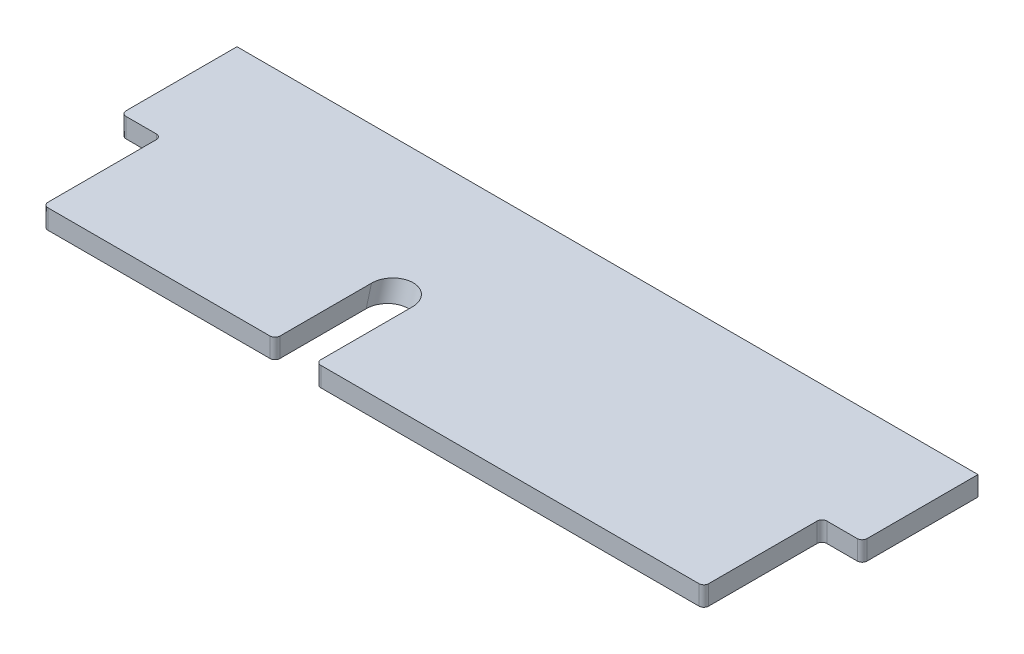
ISO-10303-21;
HEADER;
FILE_DESCRIPTION(('STEP AP214'),'2;1');
FILE_NAME('part.step','',(''),(''),'','','');
FILE_SCHEMA(('AUTOMOTIVE_DESIGN { 1 0 10303 214 1 1 1 1 }'));
ENDSEC;
DATA;
#1=APPLICATION_CONTEXT('core data for automotive mechanical design processes');
#2=APPLICATION_PROTOCOL_DEFINITION('international standard','automotive_design',2000,#1);
#3=PRODUCT_CONTEXT('',#1,'mechanical');
#4=PRODUCT('Part','Part','',(#3));
#5=PRODUCT_RELATED_PRODUCT_CATEGORY('part','',(#4));
#6=PRODUCT_DEFINITION_FORMATION('','',#4);
#7=PRODUCT_DEFINITION_CONTEXT('part definition',#1,'design');
#8=PRODUCT_DEFINITION('design','',#6,#7);
#9=PRODUCT_DEFINITION_SHAPE('','',#8);
#10=(LENGTH_UNIT() NAMED_UNIT(*) SI_UNIT(.MILLI.,.METRE.));
#11=(NAMED_UNIT(*) PLANE_ANGLE_UNIT() SI_UNIT($,.RADIAN.));
#12=(NAMED_UNIT(*) SI_UNIT($,.STERADIAN.) SOLID_ANGLE_UNIT());
#13=UNCERTAINTY_MEASURE_WITH_UNIT(LENGTH_MEASURE(1.E-05),#10,'distance_accuracy_value','');
#14=(GEOMETRIC_REPRESENTATION_CONTEXT(3) GLOBAL_UNCERTAINTY_ASSIGNED_CONTEXT((#13)) GLOBAL_UNIT_ASSIGNED_CONTEXT((#10,
#11,#12)) REPRESENTATION_CONTEXT('',''));
#15=CARTESIAN_POINT('',(0.,0.,0.));
#16=DIRECTION('',(0.,0.,1.));
#17=DIRECTION('',(1.,0.,0.));
#18=AXIS2_PLACEMENT_3D('',#15,#16,#17);
#19=CARTESIAN_POINT('',(-215.9,6.35,76.2));
#20=DIRECTION('',(0.,0.,-1.));
#21=DIRECTION('',(-1.,0.,0.));
#22=AXIS2_PLACEMENT_3D('',#19,#20,#21);
#23=PLANE('',#22);
#24=DIRECTION('',(1.,0.,0.));
#25=VECTOR('',#24,1.);
#26=CARTESIAN_POINT('',(-215.9,-6.35,76.2));
#27=LINE('',#26,#25);
#28=CARTESIAN_POINT('',(-211.963,-6.35,76.2));
#29=VERTEX_POINT('',#28);
#30=CARTESIAN_POINT('',(-67.31,-6.35,76.2));
#31=VERTEX_POINT('',#30);
#32=EDGE_CURVE('E289',#29,#31,#27,.T.);
#33=ORIENTED_EDGE('',*,*,#32,.T.);
#34=DIRECTION('',(0.,-1.,0.));
#35=VECTOR('',#34,1.);
#36=CARTESIAN_POINT('',(-67.31,6.35,76.2));
#37=LINE('',#36,#35);
#38=CARTESIAN_POINT('',(-67.31,6.35,76.2));
#39=VERTEX_POINT('',#38);
#40=EDGE_CURVE('E317',#31,#39,#37,.F.);
#41=ORIENTED_EDGE('',*,*,#40,.T.);
#42=DIRECTION('',(1.,0.,0.));
#43=VECTOR('',#42,1.);
#44=CARTESIAN_POINT('',(-215.9,6.35,76.2));
#45=LINE('',#44,#43);
#46=CARTESIAN_POINT('',(-211.963,6.35,76.2));
#47=VERTEX_POINT('',#46);
#48=EDGE_CURVE('E225',#47,#39,#45,.T.);
#49=ORIENTED_EDGE('',*,*,#48,.F.);
#50=DIRECTION('',(0.,-1.,0.));
#51=VECTOR('',#50,1.);
#52=CARTESIAN_POINT('',(-211.963,6.35,76.2));
#53=LINE('',#52,#51);
#54=EDGE_CURVE('E313',#47,#29,#53,.T.);
#55=ORIENTED_EDGE('',*,*,#54,.T.);
#56=EDGE_LOOP('',(#33,#41,#49,#55));
#57=FACE_BOUND('',#56,.T.);
#58=ADVANCED_FACE('F44',(#57),#23,.F.);
#59=CARTESIAN_POINT('',(215.138,6.35,0.));
#60=DIRECTION('',(-1.,0.,0.));
#61=DIRECTION('',(0.,0.,1.));
#62=AXIS2_PLACEMENT_3D('',#59,#60,#61);
#63=PLANE('',#62);
#64=DIRECTION('',(0.,0.,-1.));
#65=VECTOR('',#64,1.);
#66=CARTESIAN_POINT('',(215.138,-6.35,0.));
#67=LINE('',#66,#65);
#68=CARTESIAN_POINT('',(215.138,-6.35,73.025));
#69=VERTEX_POINT('',#68);
#70=CARTESIAN_POINT('',(215.138,-6.35,2.41300000000001));
#71=VERTEX_POINT('',#70);
#72=EDGE_CURVE('E237',#69,#71,#67,.T.);
#73=ORIENTED_EDGE('',*,*,#72,.T.);
#74=DIRECTION('',(0.,-1.,0.));
#75=VECTOR('',#74,1.);
#76=CARTESIAN_POINT('',(215.138,6.35,2.41300000000001));
#77=LINE('',#76,#75);
#78=CARTESIAN_POINT('',(215.138,6.35,2.41300000000001));
#79=VERTEX_POINT('',#78);
#80=EDGE_CURVE('E369',#71,#79,#77,.F.);
#81=ORIENTED_EDGE('',*,*,#80,.T.);
#82=DIRECTION('',(0.,0.,-1.));
#83=VECTOR('',#82,1.);
#84=CARTESIAN_POINT('',(215.138,6.35,0.));
#85=LINE('',#84,#83);
#86=CARTESIAN_POINT('',(215.138,6.35,73.025));
#87=VERTEX_POINT('',#86);
#88=EDGE_CURVE('E242',#87,#79,#85,.T.);
#89=ORIENTED_EDGE('',*,*,#88,.F.);
#90=DIRECTION('',(0.,-1.,0.));
#91=VECTOR('',#90,1.);
#92=CARTESIAN_POINT('',(215.138,6.35,73.025));
#93=LINE('',#92,#91);
#94=EDGE_CURVE('E365',#87,#69,#93,.T.);
#95=ORIENTED_EDGE('',*,*,#94,.T.);
#96=EDGE_LOOP('',(#73,#81,#89,#95));
#97=FACE_BOUND('',#96,.T.);
#98=ADVANCED_FACE('F425',(#97),#63,.F.);
#99=CARTESIAN_POINT('',(215.9,6.35,-0.761999999999986));
#100=DIRECTION('',(0.,0.,-1.));
#101=DIRECTION('',(-1.,0.,0.));
#102=AXIS2_PLACEMENT_3D('',#99,#100,#101);
#103=PLANE('',#102);
#104=DIRECTION('',(1.,0.,0.));
#105=VECTOR('',#104,1.);
#106=CARTESIAN_POINT('',(215.9,-6.35,-0.761999999999986));
#107=LINE('',#106,#105);
#108=CARTESIAN_POINT('',(218.313,-6.35,-0.761999999999986));
#109=VERTEX_POINT('',#108);
#110=CARTESIAN_POINT('',(238.125,-6.35,-0.761999999999986));
#111=VERTEX_POINT('',#110);
#112=EDGE_CURVE('E220',#109,#111,#107,.T.);
#113=ORIENTED_EDGE('',*,*,#112,.T.);
#114=DIRECTION('',(0.,-1.,0.));
#115=VECTOR('',#114,1.);
#116=CARTESIAN_POINT('',(238.125,6.35,-0.761999999999986));
#117=LINE('',#116,#115);
#118=CARTESIAN_POINT('',(238.125,6.35,-0.761999999999986));
#119=VERTEX_POINT('',#118);
#120=EDGE_CURVE('E362',#111,#119,#117,.F.);
#121=ORIENTED_EDGE('',*,*,#120,.T.);
#122=DIRECTION('',(1.,0.,0.));
#123=VECTOR('',#122,1.);
#124=CARTESIAN_POINT('',(215.9,6.35,-0.761999999999986));
#125=LINE('',#124,#123);
#126=CARTESIAN_POINT('',(218.313,6.35,-0.761999999999986));
#127=VERTEX_POINT('',#126);
#128=EDGE_CURVE('E236',#127,#119,#125,.T.);
#129=ORIENTED_EDGE('',*,*,#128,.F.);
#130=DIRECTION('',(0.,-1.,0.));
#131=VECTOR('',#130,1.);
#132=CARTESIAN_POINT('',(218.313,-6.35,-0.761999999999986));
#133=LINE('',#132,#131);
#134=EDGE_CURVE('E358',#127,#109,#133,.T.);
#135=ORIENTED_EDGE('',*,*,#134,.T.);
#136=EDGE_LOOP('',(#113,#121,#129,#135));
#137=FACE_BOUND('',#136,.T.);
#138=ADVANCED_FACE('F434',(#137),#103,.F.);
#139=CARTESIAN_POINT('',(241.3,6.35,-76.2));
#140=DIRECTION('',(-1.,0.,0.));
#141=DIRECTION('',(0.,0.,1.));
#142=AXIS2_PLACEMENT_3D('',#139,#140,#141);
#143=PLANE('',#142);
#144=DIRECTION('',(0.,0.,-1.));
#145=VECTOR('',#144,1.);
#146=CARTESIAN_POINT('',(241.3,6.35,-76.2));
#147=LINE('',#146,#145);
#148=CARTESIAN_POINT('',(241.3,6.35,-3.93700000000001));
#149=VERTEX_POINT('',#148);
#150=CARTESIAN_POINT('',(241.3,6.35,-76.2));
#151=VERTEX_POINT('',#150);
#152=EDGE_CURVE('E233',#149,#151,#147,.T.);
#153=ORIENTED_EDGE('',*,*,#152,.F.);
#154=DIRECTION('',(0.,-1.,0.));
#155=VECTOR('',#154,1.);
#156=CARTESIAN_POINT('',(241.3,6.35,-3.93699999999998));
#157=LINE('',#156,#155);
#158=CARTESIAN_POINT('',(241.3,-6.35,-3.93700000000001));
#159=VERTEX_POINT('',#158);
#160=EDGE_CURVE('E354',#149,#159,#157,.T.);
#161=ORIENTED_EDGE('',*,*,#160,.T.);
#162=DIRECTION('',(0.,0.,-1.));
#163=VECTOR('',#162,1.);
#164=CARTESIAN_POINT('',(241.3,-6.35,-76.2));
#165=LINE('',#164,#163);
#166=CARTESIAN_POINT('',(241.3,-6.35,-76.2));
#167=VERTEX_POINT('',#166);
#168=EDGE_CURVE('E195',#159,#167,#165,.T.);
#169=ORIENTED_EDGE('',*,*,#168,.T.);
#170=DIRECTION('',(0.,-1.,0.));
#171=VECTOR('',#170,1.);
#172=CARTESIAN_POINT('',(241.3,6.35,-76.2));
#173=LINE('',#172,#171);
#174=EDGE_CURVE('E190',#151,#167,#173,.T.);
#175=ORIENTED_EDGE('',*,*,#174,.F.);
#176=EDGE_LOOP('',(#153,#161,#169,#175));
#177=FACE_BOUND('',#176,.T.);
#178=ADVANCED_FACE('F442',(#177),#143,.F.);
#179=CARTESIAN_POINT('',(-215.9,6.35,-76.2));
#180=DIRECTION('',(0.,0.,1.));
#181=DIRECTION('',(1.,0.,0.));
#182=AXIS2_PLACEMENT_3D('',#179,#180,#181);
#183=PLANE('',#182);
#184=DIRECTION('',(-1.,0.,0.));
#185=VECTOR('',#184,1.);
#186=CARTESIAN_POINT('',(-215.9,-6.35,-76.2));
#187=LINE('',#186,#185);
#188=CARTESIAN_POINT('',(-241.3,-6.35,-76.2));
#189=VERTEX_POINT('',#188);
#190=EDGE_CURVE('E183',#167,#189,#187,.T.);
#191=ORIENTED_EDGE('',*,*,#190,.T.);
#192=DIRECTION('',(0.,-1.,0.));
#193=VECTOR('',#192,1.);
#194=CARTESIAN_POINT('',(-241.3,6.35,-76.2));
#195=LINE('',#194,#193);
#196=CARTESIAN_POINT('',(-241.3,6.35,-76.2));
#197=VERTEX_POINT('',#196);
#198=EDGE_CURVE('E187',#197,#189,#195,.T.);
#199=ORIENTED_EDGE('',*,*,#198,.F.);
#200=DIRECTION('',(-1.,0.,0.));
#201=VECTOR('',#200,1.);
#202=CARTESIAN_POINT('',(215.9,6.35,-76.2));
#203=LINE('',#202,#201);
#204=EDGE_CURVE('E230',#151,#197,#203,.T.);
#205=ORIENTED_EDGE('',*,*,#204,.F.);
#206=ORIENTED_EDGE('',*,*,#174,.T.);
#207=EDGE_LOOP('',(#191,#199,#205,#206));
#208=FACE_BOUND('',#207,.T.);
#209=ADVANCED_FACE('F185',(#208),#183,.F.);
#210=CARTESIAN_POINT('',(-241.3,6.35,-76.2));
#211=DIRECTION('',(1.,0.,0.));
#212=DIRECTION('',(0.,0.,-1.));
#213=AXIS2_PLACEMENT_3D('',#210,#211,#212);
#214=PLANE('',#213);
#215=DIRECTION('',(0.,0.,1.));
#216=VECTOR('',#215,1.);
#217=CARTESIAN_POINT('',(-241.3,-6.35,-76.2));
#218=LINE('',#217,#216);
#219=CARTESIAN_POINT('',(-241.3,-6.35,-3.93700000000001));
#220=VERTEX_POINT('',#219);
#221=EDGE_CURVE('E200',#189,#220,#218,.T.);
#222=ORIENTED_EDGE('',*,*,#221,.T.);
#223=DIRECTION('',(0.,-1.,0.));
#224=VECTOR('',#223,1.);
#225=CARTESIAN_POINT('',(-241.3,6.35,-3.93699999999998));
#226=LINE('',#225,#224);
#227=CARTESIAN_POINT('',(-241.3,6.35,-3.93700000000001));
#228=VERTEX_POINT('',#227);
#229=EDGE_CURVE('E351',#220,#228,#226,.F.);
#230=ORIENTED_EDGE('',*,*,#229,.T.);
#231=DIRECTION('',(0.,0.,1.));
#232=VECTOR('',#231,1.);
#233=CARTESIAN_POINT('',(-241.3,6.35,-76.2));
#234=LINE('',#233,#232);
#235=EDGE_CURVE('E203',#197,#228,#234,.T.);
#236=ORIENTED_EDGE('',*,*,#235,.F.);
#237=ORIENTED_EDGE('',*,*,#198,.T.);
#238=EDGE_LOOP('',(#222,#230,#236,#237));
#239=FACE_BOUND('',#238,.T.);
#240=ADVANCED_FACE('F199',(#239),#214,.F.);
#241=CARTESIAN_POINT('',(-215.9,6.35,-0.76199999999999));
#242=DIRECTION('',(0.,0.,-1.));
#243=DIRECTION('',(-1.,0.,0.));
#244=AXIS2_PLACEMENT_3D('',#241,#242,#243);
#245=PLANE('',#244);
#246=DIRECTION('',(1.,0.,0.));
#247=VECTOR('',#246,1.);
#248=CARTESIAN_POINT('',(-215.9,6.35,-0.76199999999999));
#249=LINE('',#248,#247);
#250=CARTESIAN_POINT('',(-238.125,6.35,-0.761999999999987));
#251=VERTEX_POINT('',#250);
#252=CARTESIAN_POINT('',(-218.313,6.35,-0.761999999999989));
#253=VERTEX_POINT('',#252);
#254=EDGE_CURVE('E229',#251,#253,#249,.T.);
#255=ORIENTED_EDGE('',*,*,#254,.F.);
#256=DIRECTION('',(0.,-1.,0.));
#257=VECTOR('',#256,1.);
#258=CARTESIAN_POINT('',(-238.125,6.35,-0.761999999999987));
#259=LINE('',#258,#257);
#260=CARTESIAN_POINT('',(-238.125,-6.35,-0.761999999999987));
#261=VERTEX_POINT('',#260);
#262=EDGE_CURVE('E347',#251,#261,#259,.T.);
#263=ORIENTED_EDGE('',*,*,#262,.T.);
#264=DIRECTION('',(1.,0.,0.));
#265=VECTOR('',#264,1.);
#266=CARTESIAN_POINT('',(-215.9,-6.35,-0.76199999999999));
#267=LINE('',#266,#265);
#268=CARTESIAN_POINT('',(-218.313,-6.35,-0.761999999999989));
#269=VERTEX_POINT('',#268);
#270=EDGE_CURVE('E205',#261,#269,#267,.T.);
#271=ORIENTED_EDGE('',*,*,#270,.T.);
#272=DIRECTION('',(0.,-1.,0.));
#273=VECTOR('',#272,1.);
#274=CARTESIAN_POINT('',(-218.313,6.35,-0.761999999999989));
#275=LINE('',#274,#273);
#276=EDGE_CURVE('E344',#269,#253,#275,.F.);
#277=ORIENTED_EDGE('',*,*,#276,.T.);
#278=EDGE_LOOP('',(#255,#263,#271,#277));
#279=FACE_BOUND('',#278,.T.);
#280=ADVANCED_FACE('F394',(#279),#245,.F.);
#281=CARTESIAN_POINT('',(-215.138,6.35,0.));
#282=DIRECTION('',(1.,0.,0.));
#283=DIRECTION('',(0.,0.,-1.));
#284=AXIS2_PLACEMENT_3D('',#281,#282,#283);
#285=PLANE('',#284);
#286=DIRECTION('',(0.,0.,1.));
#287=VECTOR('',#286,1.);
#288=CARTESIAN_POINT('',(-215.138,-6.35,0.));
#289=LINE('',#288,#287);
#290=CARTESIAN_POINT('',(-215.138,-6.35,2.41300000000001));
#291=VERTEX_POINT('',#290);
#292=CARTESIAN_POINT('',(-215.138,-6.35,73.025));
#293=VERTEX_POINT('',#292);
#294=EDGE_CURVE('E253',#291,#293,#289,.T.);
#295=ORIENTED_EDGE('',*,*,#294,.T.);
#296=DIRECTION('',(0.,-1.,0.));
#297=VECTOR('',#296,1.);
#298=CARTESIAN_POINT('',(-215.138,6.35,73.025));
#299=LINE('',#298,#297);
#300=CARTESIAN_POINT('',(-215.138,6.35,73.025));
#301=VERTEX_POINT('',#300);
#302=EDGE_CURVE('E60',#293,#301,#299,.F.);
#303=ORIENTED_EDGE('',*,*,#302,.T.);
#304=DIRECTION('',(0.,0.,1.));
#305=VECTOR('',#304,1.);
#306=CARTESIAN_POINT('',(-215.138,6.35,0.));
#307=LINE('',#306,#305);
#308=CARTESIAN_POINT('',(-215.138,6.35,2.41300000000001));
#309=VERTEX_POINT('',#308);
#310=EDGE_CURVE('E226',#309,#301,#307,.T.);
#311=ORIENTED_EDGE('',*,*,#310,.F.);
#312=DIRECTION('',(0.,-1.,0.));
#313=VECTOR('',#312,1.);
#314=CARTESIAN_POINT('',(-215.138,-6.35,2.41300000000001));
#315=LINE('',#314,#313);
#316=EDGE_CURVE('E338',#309,#291,#315,.T.);
#317=ORIENTED_EDGE('',*,*,#316,.T.);
#318=EDGE_LOOP('',(#295,#303,#311,#317));
#319=FACE_BOUND('',#318,.T.);
#320=ADVANCED_FACE('F396',(#319),#285,.F.);
#321=CARTESIAN_POINT('',(-34.2899999999998,-6.35,76.2));
#322=VERTEX_POINT('',#321);
#323=CARTESIAN_POINT('',(211.963,-6.35,76.2));
#324=VERTEX_POINT('',#323);
#325=EDGE_CURVE('E216',#322,#324,#27,.T.);
#326=ORIENTED_EDGE('',*,*,#325,.T.);
#327=DIRECTION('',(0.,-1.,0.));
#328=VECTOR('',#327,1.);
#329=CARTESIAN_POINT('',(211.963,6.35,76.2));
#330=LINE('',#329,#328);
#331=CARTESIAN_POINT('',(211.963,6.35,76.2));
#332=VERTEX_POINT('',#331);
#333=EDGE_CURVE('E375',#324,#332,#330,.F.);
#334=ORIENTED_EDGE('',*,*,#333,.T.);
#335=CARTESIAN_POINT('',(-34.2899999999998,6.35,76.2));
#336=VERTEX_POINT('',#335);
#337=EDGE_CURVE('E221',#336,#332,#45,.T.);
#338=ORIENTED_EDGE('',*,*,#337,.F.);
#339=DIRECTION('',(0.,1.,0.));
#340=VECTOR('',#339,1.);
#341=CARTESIAN_POINT('',(-34.2899999999998,6.3500000000001,76.2));
#342=LINE('',#341,#340);
#343=EDGE_CURVE('E372',#336,#322,#342,.F.);
#344=ORIENTED_EDGE('',*,*,#343,.T.);
#345=EDGE_LOOP('',(#326,#334,#338,#344));
#346=FACE_BOUND('',#345,.T.);
#347=ADVANCED_FACE('F414',(#346),#23,.F.);
#348=CARTESIAN_POINT('',(0.,6.35,0.));
#349=DIRECTION('',(0.,1.,0.));
#350=DIRECTION('',(0.,0.,1.));
#351=AXIS2_PLACEMENT_3D('',#348,#349,#350);
#352=PLANE('',#351);
#353=ORIENTED_EDGE('',*,*,#48,.T.);
#354=CARTESIAN_POINT('',(-67.31,6.35,73.025));
#355=DIRECTION('',(0.,1.,0.));
#356=DIRECTION('',(0.,0.,1.));
#357=AXIS2_PLACEMENT_3D('',#354,#355,#356);
#358=CIRCLE('',#357,3.175);
#359=CARTESIAN_POINT('',(-64.135,6.35,73.025));
#360=VERTEX_POINT('',#359);
#361=EDGE_CURVE('E335',#39,#360,#358,.T.);
#362=ORIENTED_EDGE('',*,*,#361,.T.);
#363=DIRECTION('',(0.,0.,1.));
#364=VECTOR('',#363,1.);
#365=CARTESIAN_POINT('',(-64.135,6.35,0.));
#366=LINE('',#365,#364);
#367=CARTESIAN_POINT('',(-64.135,6.34999999999999,13.3639769330719));
#368=VERTEX_POINT('',#367);
#369=EDGE_CURVE('E265',#368,#360,#366,.T.);
#370=ORIENTED_EDGE('',*,*,#369,.F.);
#371=CARTESIAN_POINT('',(-50.7999999999986,6.34999999999999,13.3639769330719));
#372=DIRECTION('',(0.,1.,0.));
#373=DIRECTION('',(0.,0.,-1.));
#374=AXIS2_PLACEMENT_3D('',#371,#372,#373);
#375=ELLIPSE('',#374,13.8160367727838,13.3350000000001);
#376=CARTESIAN_POINT('',(-37.4649999999998,6.34999999999999,13.3639769330719));
#377=VERTEX_POINT('',#376);
#378=EDGE_CURVE('E246',#368,#377,#375,.F.);
#379=ORIENTED_EDGE('',*,*,#378,.T.);
#380=DIRECTION('',(0.,0.,1.));
#381=VECTOR('',#380,1.);
#382=CARTESIAN_POINT('',(-37.4649999999998,6.35,-76.201));
#383=LINE('',#382,#381);
#384=CARTESIAN_POINT('',(-37.4649999999998,6.35,73.025));
#385=VERTEX_POINT('',#384);
#386=EDGE_CURVE('E275',#377,#385,#383,.T.);
#387=ORIENTED_EDGE('',*,*,#386,.T.);
#388=CARTESIAN_POINT('',(-34.2899999999998,6.35,73.025));
#389=DIRECTION('',(0.,1.,0.));
#390=DIRECTION('',(0.,0.,1.));
#391=AXIS2_PLACEMENT_3D('',#388,#389,#390);
#392=CIRCLE('',#391,3.175);
#393=EDGE_CURVE('E320',#385,#336,#392,.T.);
#394=ORIENTED_EDGE('',*,*,#393,.T.);
#395=ORIENTED_EDGE('',*,*,#337,.T.);
#396=CARTESIAN_POINT('',(211.963,6.35,73.025));
#397=DIRECTION('',(0.,1.,0.));
#398=DIRECTION('',(0.,0.,1.));
#399=AXIS2_PLACEMENT_3D('',#396,#397,#398);
#400=CIRCLE('',#399,3.175);
#401=EDGE_CURVE('E323',#332,#87,#400,.T.);
#402=ORIENTED_EDGE('',*,*,#401,.T.);
#403=ORIENTED_EDGE('',*,*,#88,.T.);
#404=CARTESIAN_POINT('',(218.313,6.35,2.41300000000001));
#405=DIRECTION('',(0.,1.,0.));
#406=DIRECTION('',(0.,0.,1.));
#407=AXIS2_PLACEMENT_3D('',#404,#405,#406);
#408=CIRCLE('',#407,3.175);
#409=EDGE_CURVE('E385',#79,#127,#408,.F.);
#410=ORIENTED_EDGE('',*,*,#409,.T.);
#411=ORIENTED_EDGE('',*,*,#128,.T.);
#412=CARTESIAN_POINT('',(238.125,6.35,-3.93699999999998));
#413=DIRECTION('',(0.,1.,0.));
#414=DIRECTION('',(0.,0.,1.));
#415=AXIS2_PLACEMENT_3D('',#412,#413,#414);
#416=CIRCLE('',#415,3.175);
#417=EDGE_CURVE('E326',#119,#149,#416,.T.);
#418=ORIENTED_EDGE('',*,*,#417,.T.);
#419=ORIENTED_EDGE('',*,*,#152,.T.);
#420=ORIENTED_EDGE('',*,*,#204,.T.);
#421=ORIENTED_EDGE('',*,*,#235,.T.);
#422=CARTESIAN_POINT('',(-238.125,6.35,-3.93699999999999));
#423=DIRECTION('',(0.,1.,0.));
#424=DIRECTION('',(0.,0.,1.));
#425=AXIS2_PLACEMENT_3D('',#422,#423,#424);
#426=CIRCLE('',#425,3.175);
#427=EDGE_CURVE('E329',#228,#251,#426,.T.);
#428=ORIENTED_EDGE('',*,*,#427,.T.);
#429=ORIENTED_EDGE('',*,*,#254,.T.);
#430=CARTESIAN_POINT('',(-218.313,6.35,2.41300000000001));
#431=DIRECTION('',(0.,1.,0.));
#432=DIRECTION('',(0.,0.,1.));
#433=AXIS2_PLACEMENT_3D('',#430,#431,#432);
#434=CIRCLE('',#433,3.175);
#435=EDGE_CURVE('E12',#253,#309,#434,.F.);
#436=ORIENTED_EDGE('',*,*,#435,.T.);
#437=ORIENTED_EDGE('',*,*,#310,.T.);
#438=CARTESIAN_POINT('',(-211.963,6.35,73.025));
#439=DIRECTION('',(0.,1.,0.));
#440=DIRECTION('',(0.,0.,1.));
#441=AXIS2_PLACEMENT_3D('',#438,#439,#440);
#442=CIRCLE('',#441,3.175);
#443=EDGE_CURVE('E332',#301,#47,#442,.T.);
#444=ORIENTED_EDGE('',*,*,#443,.T.);
#445=EDGE_LOOP('',(#353,#362,#370,#379,#387,#394,#395,#402,#403,#410,#411,#418,#419,#420,#421,
#428,#429,#436,#437,#444));
#446=FACE_BOUND('',#445,.T.);
#447=ADVANCED_FACE('F399',(#446),#352,.T.);
#448=CARTESIAN_POINT('',(0.,-6.35,0.));
#449=DIRECTION('',(0.,1.,0.));
#450=DIRECTION('',(0.,0.,1.));
#451=AXIS2_PLACEMENT_3D('',#448,#449,#450);
#452=PLANE('',#451);
#453=DIRECTION('',(0.,0.,1.));
#454=VECTOR('',#453,1.);
#455=CARTESIAN_POINT('',(-64.135,-6.35,0.));
#456=LINE('',#455,#454);
#457=CARTESIAN_POINT('',(-64.135,-6.34999999999999,16.8058357235667));
#458=VERTEX_POINT('',#457);
#459=CARTESIAN_POINT('',(-64.135,-6.35,73.025));
#460=VERTEX_POINT('',#459);
#461=EDGE_CURVE('E270',#458,#460,#456,.T.);
#462=ORIENTED_EDGE('',*,*,#461,.T.);
#463=CARTESIAN_POINT('',(-67.31,-6.35,73.025));
#464=DIRECTION('',(0.,1.,0.));
#465=DIRECTION('',(0.,0.,1.));
#466=AXIS2_PLACEMENT_3D('',#463,#464,#465);
#467=CIRCLE('',#466,3.175);
#468=EDGE_CURVE('E310',#460,#31,#467,.F.);
#469=ORIENTED_EDGE('',*,*,#468,.T.);
#470=ORIENTED_EDGE('',*,*,#32,.F.);
#471=CARTESIAN_POINT('',(-211.963,-6.35,73.025));
#472=DIRECTION('',(0.,1.,0.));
#473=DIRECTION('',(0.,0.,1.));
#474=AXIS2_PLACEMENT_3D('',#471,#472,#473);
#475=CIRCLE('',#474,3.175);
#476=EDGE_CURVE('E307',#29,#293,#475,.F.);
#477=ORIENTED_EDGE('',*,*,#476,.T.);
#478=ORIENTED_EDGE('',*,*,#294,.F.);
#479=CARTESIAN_POINT('',(-218.313,-6.35,2.41300000000001));
#480=DIRECTION('',(0.,1.,0.));
#481=DIRECTION('',(0.,0.,1.));
#482=AXIS2_PLACEMENT_3D('',#479,#480,#481);
#483=CIRCLE('',#482,3.175);
#484=EDGE_CURVE('E53',#291,#269,#483,.T.);
#485=ORIENTED_EDGE('',*,*,#484,.T.);
#486=ORIENTED_EDGE('',*,*,#270,.F.);
#487=CARTESIAN_POINT('',(-238.125,-6.35,-3.93699999999999));
#488=DIRECTION('',(0.,1.,0.));
#489=DIRECTION('',(0.,0.,1.));
#490=AXIS2_PLACEMENT_3D('',#487,#488,#489);
#491=CIRCLE('',#490,3.175);
#492=EDGE_CURVE('E210',#261,#220,#491,.F.);
#493=ORIENTED_EDGE('',*,*,#492,.T.);
#494=ORIENTED_EDGE('',*,*,#221,.F.);
#495=ORIENTED_EDGE('',*,*,#190,.F.);
#496=ORIENTED_EDGE('',*,*,#168,.F.);
#497=CARTESIAN_POINT('',(238.125,-6.35,-3.93699999999998));
#498=DIRECTION('',(0.,1.,0.));
#499=DIRECTION('',(0.,0.,1.));
#500=AXIS2_PLACEMENT_3D('',#497,#498,#499);
#501=CIRCLE('',#500,3.175);
#502=EDGE_CURVE('E302',#159,#111,#501,.F.);
#503=ORIENTED_EDGE('',*,*,#502,.T.);
#504=ORIENTED_EDGE('',*,*,#112,.F.);
#505=CARTESIAN_POINT('',(218.313,-6.35,2.41300000000001));
#506=DIRECTION('',(0.,1.,0.));
#507=DIRECTION('',(0.,0.,1.));
#508=AXIS2_PLACEMENT_3D('',#505,#506,#507);
#509=CIRCLE('',#508,3.175);
#510=EDGE_CURVE('E382',#109,#71,#509,.T.);
#511=ORIENTED_EDGE('',*,*,#510,.T.);
#512=ORIENTED_EDGE('',*,*,#72,.F.);
#513=CARTESIAN_POINT('',(211.963,-6.35,73.025));
#514=DIRECTION('',(0.,1.,0.));
#515=DIRECTION('',(0.,0.,1.));
#516=AXIS2_PLACEMENT_3D('',#513,#514,#515);
#517=CIRCLE('',#516,3.175);
#518=EDGE_CURVE('E299',#69,#324,#517,.F.);
#519=ORIENTED_EDGE('',*,*,#518,.T.);
#520=ORIENTED_EDGE('',*,*,#325,.F.);
#521=CARTESIAN_POINT('',(-34.2899999999998,-6.35,73.025));
#522=DIRECTION('',(0.,1.,0.));
#523=DIRECTION('',(0.,0.,1.));
#524=AXIS2_PLACEMENT_3D('',#521,#522,#523);
#525=CIRCLE('',#524,3.175);
#526=CARTESIAN_POINT('',(-37.4649999999998,-6.35,73.025));
#527=VERTEX_POINT('',#526);
#528=EDGE_CURVE('E296',#322,#527,#525,.F.);
#529=ORIENTED_EDGE('',*,*,#528,.T.);
#530=DIRECTION('',(0.,0.,1.));
#531=VECTOR('',#530,1.);
#532=CARTESIAN_POINT('',(-37.4649999999998,-6.35,-76.201));
#533=LINE('',#532,#531);
#534=CARTESIAN_POINT('',(-37.4649999999998,-6.34999999999999,16.8058357235667));
#535=VERTEX_POINT('',#534);
#536=EDGE_CURVE('E271',#535,#527,#533,.T.);
#537=ORIENTED_EDGE('',*,*,#536,.F.);
#538=CARTESIAN_POINT('',(-50.7999999999986,-6.34999999999999,16.8058357235667));
#539=DIRECTION('',(0.,1.,0.));
#540=DIRECTION('',(0.,0.,-1.));
#541=AXIS2_PLACEMENT_3D('',#538,#539,#540);
#542=ELLIPSE('',#541,13.8160367727838,13.3350000000001);
#543=EDGE_CURVE('E276',#458,#535,#542,.F.);
#544=ORIENTED_EDGE('',*,*,#543,.F.);
#545=EDGE_LOOP('',(#462,#469,#470,#477,#478,#485,#486,#493,#494,#495,#496,#503,#504,#511,#512,
#519,#520,#529,#537,#544));
#546=FACE_BOUND('',#545,.T.);
#547=ADVANCED_FACE('F208',(#546),#452,.F.);
#548=CARTESIAN_POINT('',(-50.7999999999986,-171.450000000005,61.5499999999998));
#549=DIRECTION('',(0.,0.965182723476006,-0.261576585923588));
#550=DIRECTION('',(0.,-0.261576585923588,-0.965182723476006));
#551=AXIS2_PLACEMENT_3D('',#548,#549,#550);
#552=CYLINDRICAL_SURFACE('',#551,13.3350000000001);
#553=DIRECTION('',(0.,0.965182723476006,-0.261576585923588));
#554=VECTOR('',#553,1.);
#555=CARTESIAN_POINT('',(-64.1349999999987,-171.450000000005,61.5499999999998));
#556=LINE('',#555,#554);
#557=EDGE_CURVE('E266',#368,#458,#556,.F.);
#558=ORIENTED_EDGE('',*,*,#557,.T.);
#559=ORIENTED_EDGE('',*,*,#543,.T.);
#560=DIRECTION('',(0.,0.965182723476006,-0.261576585923588));
#561=VECTOR('',#560,1.);
#562=CARTESIAN_POINT('',(-37.4649999999985,-171.450000000005,61.5499999999998));
#563=LINE('',#562,#561);
#564=EDGE_CURVE('E241',#377,#535,#563,.F.);
#565=ORIENTED_EDGE('',*,*,#564,.F.);
#566=ORIENTED_EDGE('',*,*,#378,.F.);
#567=EDGE_LOOP('',(#558,#559,#565,#566));
#568=FACE_BOUND('',#567,.T.);
#569=ADVANCED_FACE('F481',(#568),#552,.F.);
#570=CARTESIAN_POINT('',(-37.4649999999998,6.34999999999999,-76.201));
#571=DIRECTION('',(1.,0.,0.));
#572=DIRECTION('',(0.,1.,0.));
#573=AXIS2_PLACEMENT_3D('',#570,#571,#572);
#574=PLANE('',#573);
#575=ORIENTED_EDGE('',*,*,#536,.T.);
#576=DIRECTION('',(0.,1.,0.));
#577=VECTOR('',#576,1.);
#578=CARTESIAN_POINT('',(-37.4649999999998,6.34999999999999,73.025));
#579=LINE('',#578,#577);
#580=EDGE_CURVE('E378',#527,#385,#579,.T.);
#581=ORIENTED_EDGE('',*,*,#580,.T.);
#582=ORIENTED_EDGE('',*,*,#386,.F.);
#583=ORIENTED_EDGE('',*,*,#564,.T.);
#584=EDGE_LOOP('',(#575,#581,#582,#583));
#585=FACE_BOUND('',#584,.T.);
#586=ADVANCED_FACE('F477',(#585),#574,.F.);
#587=CARTESIAN_POINT('',(-64.135,6.34999999999999,-76.201));
#588=DIRECTION('',(-1.,0.,0.));
#589=DIRECTION('',(0.,0.,1.));
#590=AXIS2_PLACEMENT_3D('',#587,#588,#589);
#591=PLANE('',#590);
#592=ORIENTED_EDGE('',*,*,#369,.T.);
#593=DIRECTION('',(0.,-1.,0.));
#594=VECTOR('',#593,1.);
#595=CARTESIAN_POINT('',(-64.135,6.34999999999999,73.025));
#596=LINE('',#595,#594);
#597=EDGE_CURVE('E280',#360,#460,#596,.T.);
#598=ORIENTED_EDGE('',*,*,#597,.T.);
#599=ORIENTED_EDGE('',*,*,#461,.F.);
#600=ORIENTED_EDGE('',*,*,#557,.F.);
#601=EDGE_LOOP('',(#592,#598,#599,#600));
#602=FACE_BOUND('',#601,.T.);
#603=ADVANCED_FACE('F480',(#602),#591,.F.);
#604=CARTESIAN_POINT('',(-67.31,6.34999999999999,73.025));
#605=DIRECTION('',(0.,-1.,0.));
#606=DIRECTION('',(0.,0.,-1.));
#607=AXIS2_PLACEMENT_3D('',#604,#605,#606);
#608=CYLINDRICAL_SURFACE('',#607,3.175);
#609=ORIENTED_EDGE('',*,*,#361,.F.);
#610=ORIENTED_EDGE('',*,*,#40,.F.);
#611=ORIENTED_EDGE('',*,*,#468,.F.);
#612=ORIENTED_EDGE('',*,*,#597,.F.);
#613=EDGE_LOOP('',(#609,#610,#611,#612));
#614=FACE_BOUND('',#613,.T.);
#615=ADVANCED_FACE('F453',(#614),#608,.T.);
#616=CARTESIAN_POINT('',(-211.963,6.35,73.025));
#617=DIRECTION('',(0.,-1.,0.));
#618=DIRECTION('',(0.,0.,-1.));
#619=AXIS2_PLACEMENT_3D('',#616,#617,#618);
#620=CYLINDRICAL_SURFACE('',#619,3.175);
#621=ORIENTED_EDGE('',*,*,#443,.F.);
#622=ORIENTED_EDGE('',*,*,#302,.F.);
#623=ORIENTED_EDGE('',*,*,#476,.F.);
#624=ORIENTED_EDGE('',*,*,#54,.F.);
#625=EDGE_LOOP('',(#621,#622,#623,#624));
#626=FACE_BOUND('',#625,.T.);
#627=ADVANCED_FACE('F403',(#626),#620,.T.);
#628=CARTESIAN_POINT('',(-238.125,6.35,-3.93699999999999));
#629=DIRECTION('',(0.,-1.,0.));
#630=DIRECTION('',(0.,0.,-1.));
#631=AXIS2_PLACEMENT_3D('',#628,#629,#630);
#632=CYLINDRICAL_SURFACE('',#631,3.175);
#633=ORIENTED_EDGE('',*,*,#427,.F.);
#634=ORIENTED_EDGE('',*,*,#229,.F.);
#635=ORIENTED_EDGE('',*,*,#492,.F.);
#636=ORIENTED_EDGE('',*,*,#262,.F.);
#637=EDGE_LOOP('',(#633,#634,#635,#636));
#638=FACE_BOUND('',#637,.T.);
#639=ADVANCED_FACE('F445',(#638),#632,.T.);
#640=CARTESIAN_POINT('',(238.125,6.35,-3.93699999999998));
#641=DIRECTION('',(0.,-1.,0.));
#642=DIRECTION('',(0.,0.,-1.));
#643=AXIS2_PLACEMENT_3D('',#640,#641,#642);
#644=CYLINDRICAL_SURFACE('',#643,3.175);
#645=ORIENTED_EDGE('',*,*,#417,.F.);
#646=ORIENTED_EDGE('',*,*,#120,.F.);
#647=ORIENTED_EDGE('',*,*,#502,.F.);
#648=ORIENTED_EDGE('',*,*,#160,.F.);
#649=EDGE_LOOP('',(#645,#646,#647,#648));
#650=FACE_BOUND('',#649,.T.);
#651=ADVANCED_FACE('F438',(#650),#644,.T.);
#652=CARTESIAN_POINT('',(218.313,6.35,2.41300000000001));
#653=DIRECTION('',(0.,1.,0.));
#654=DIRECTION('',(0.,0.,1.));
#655=AXIS2_PLACEMENT_3D('',#652,#653,#654);
#656=CYLINDRICAL_SURFACE('',#655,3.175);
#657=ORIENTED_EDGE('',*,*,#409,.F.);
#658=ORIENTED_EDGE('',*,*,#80,.F.);
#659=ORIENTED_EDGE('',*,*,#510,.F.);
#660=ORIENTED_EDGE('',*,*,#134,.F.);
#661=EDGE_LOOP('',(#657,#658,#659,#660));
#662=FACE_BOUND('',#661,.T.);
#663=ADVANCED_FACE('F429',(#662),#656,.F.);
#664=CARTESIAN_POINT('',(211.963,6.35,73.025));
#665=DIRECTION('',(0.,-1.,0.));
#666=DIRECTION('',(0.,0.,-1.));
#667=AXIS2_PLACEMENT_3D('',#664,#665,#666);
#668=CYLINDRICAL_SURFACE('',#667,3.175);
#669=ORIENTED_EDGE('',*,*,#401,.F.);
#670=ORIENTED_EDGE('',*,*,#333,.F.);
#671=ORIENTED_EDGE('',*,*,#518,.F.);
#672=ORIENTED_EDGE('',*,*,#94,.F.);
#673=EDGE_LOOP('',(#669,#670,#671,#672));
#674=FACE_BOUND('',#673,.T.);
#675=ADVANCED_FACE('F420',(#674),#668,.T.);
#676=CARTESIAN_POINT('',(-34.2899999999998,6.35,73.025));
#677=DIRECTION('',(0.,1.,0.));
#678=DIRECTION('',(-1.,0.,0.));
#679=AXIS2_PLACEMENT_3D('',#676,#677,#678);
#680=CYLINDRICAL_SURFACE('',#679,3.175);
#681=ORIENTED_EDGE('',*,*,#528,.F.);
#682=ORIENTED_EDGE('',*,*,#343,.F.);
#683=ORIENTED_EDGE('',*,*,#393,.F.);
#684=ORIENTED_EDGE('',*,*,#580,.F.);
#685=EDGE_LOOP('',(#681,#682,#683,#684));
#686=FACE_BOUND('',#685,.T.);
#687=ADVANCED_FACE('F502',(#686),#680,.T.);
#688=CARTESIAN_POINT('',(-218.313,6.35,2.41300000000001));
#689=DIRECTION('',(0.,1.,0.));
#690=DIRECTION('',(0.,0.,1.));
#691=AXIS2_PLACEMENT_3D('',#688,#689,#690);
#692=CYLINDRICAL_SURFACE('',#691,3.175);
#693=ORIENTED_EDGE('',*,*,#435,.F.);
#694=ORIENTED_EDGE('',*,*,#276,.F.);
#695=ORIENTED_EDGE('',*,*,#484,.F.);
#696=ORIENTED_EDGE('',*,*,#316,.F.);
#697=EDGE_LOOP('',(#693,#694,#695,#696));
#698=FACE_BOUND('',#697,.T.);
#699=ADVANCED_FACE('F46',(#698),#692,.F.);
#700=CLOSED_SHELL('',(#58,#98,#138,#178,#209,#240,#280,#320,#347,#447,#547,#569,#586,#603,#615,
#627,#639,#651,#663,#675,#687,#699));
#701=MANIFOLD_SOLID_BREP('B2',#700);
#702=ADVANCED_BREP_SHAPE_REPRESENTATION('',(#18,#701),#14);
#703=SHAPE_DEFINITION_REPRESENTATION(#9,#702);
ENDSEC;
END-ISO-10303-21;
